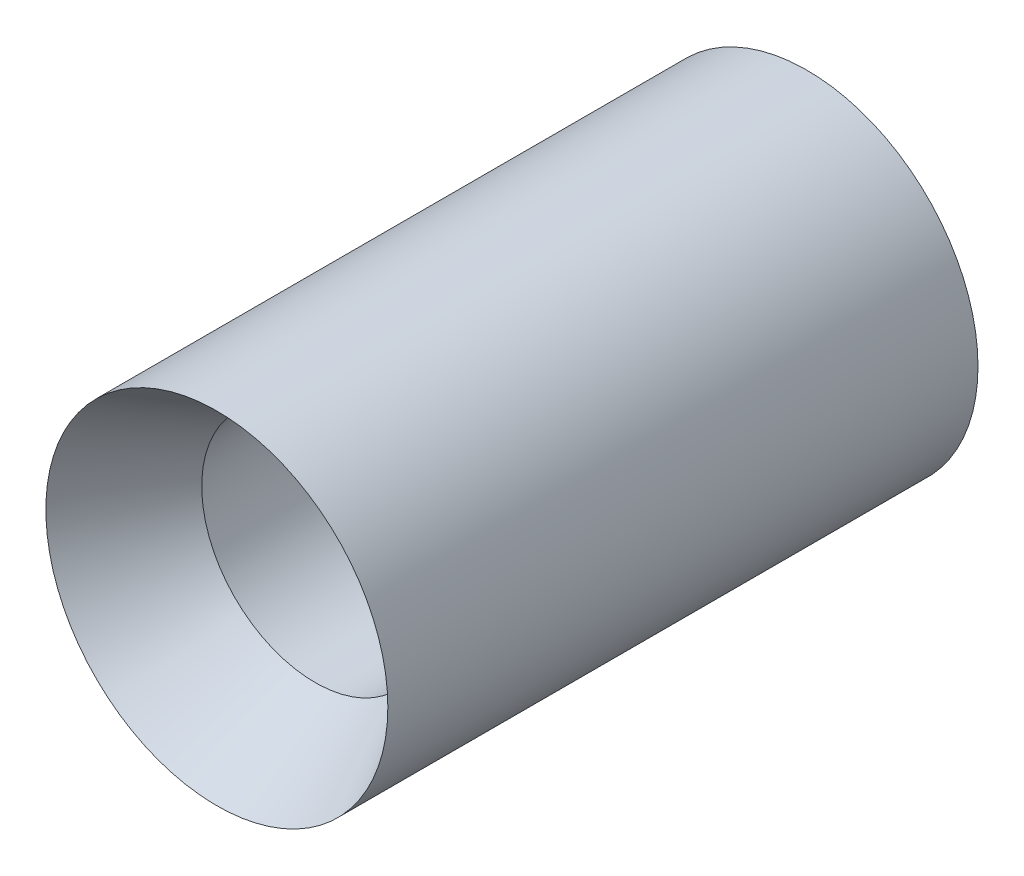
ISO-10303-21;
HEADER;
FILE_DESCRIPTION(('STEP AP214'),'2;1');
FILE_NAME('part.step','',(''),(''),'','','');
FILE_SCHEMA(('AUTOMOTIVE_DESIGN { 1 0 10303 214 1 1 1 1 }'));
ENDSEC;
DATA;
#1=APPLICATION_CONTEXT('core data for automotive mechanical design processes');
#2=APPLICATION_PROTOCOL_DEFINITION('international standard','automotive_design',2000,#1);
#3=PRODUCT_CONTEXT('',#1,'mechanical');
#4=PRODUCT('Part','Part','',(#3));
#5=PRODUCT_RELATED_PRODUCT_CATEGORY('part','',(#4));
#6=PRODUCT_DEFINITION_FORMATION('','',#4);
#7=PRODUCT_DEFINITION_CONTEXT('part definition',#1,'design');
#8=PRODUCT_DEFINITION('design','',#6,#7);
#9=PRODUCT_DEFINITION_SHAPE('','',#8);
#10=(LENGTH_UNIT() NAMED_UNIT(*) SI_UNIT(.MILLI.,.METRE.));
#11=(NAMED_UNIT(*) PLANE_ANGLE_UNIT() SI_UNIT($,.RADIAN.));
#12=(NAMED_UNIT(*) SI_UNIT($,.STERADIAN.) SOLID_ANGLE_UNIT());
#13=UNCERTAINTY_MEASURE_WITH_UNIT(LENGTH_MEASURE(1.E-05),#10,'distance_accuracy_value','');
#14=(GEOMETRIC_REPRESENTATION_CONTEXT(3) GLOBAL_UNCERTAINTY_ASSIGNED_CONTEXT((#13)) GLOBAL_UNIT_ASSIGNED_CONTEXT((#10,
#11,#12)) REPRESENTATION_CONTEXT('',''));
#15=CARTESIAN_POINT('',(0.,0.,0.));
#16=DIRECTION('',(0.,0.,1.));
#17=DIRECTION('',(1.,0.,0.));
#18=AXIS2_PLACEMENT_3D('',#15,#16,#17);
#19=CARTESIAN_POINT('',(0.,0.,0.));
#20=DIRECTION('',(0.,0.,1.));
#21=DIRECTION('',(1.,0.,0.));
#22=AXIS2_PLACEMENT_3D('',#19,#20,#21);
#23=CONICAL_SURFACE('',#22,14.351,0.529030471079648);
#24=CARTESIAN_POINT('',(0.,0.,-8.255));
#25=DIRECTION('',(0.,0.,1.));
#26=DIRECTION('',(1.,0.,0.));
#27=AXIS2_PLACEMENT_3D('',#24,#25,#26);
#28=CIRCLE('',#27,9.525);
#29=CARTESIAN_POINT('',(9.525,0.,-8.255));
#30=VERTEX_POINT('',#29);
#31=EDGE_CURVE('E54',#30,#30,#28,.T.);
#32=ORIENTED_EDGE('',*,*,#31,.F.);
#33=EDGE_LOOP('',(#32));
#34=FACE_BOUND('',#33,.T.);
#35=CARTESIAN_POINT('',(0.,0.,0.));
#36=DIRECTION('',(0.,0.,1.));
#37=DIRECTION('',(1.,0.,0.));
#38=AXIS2_PLACEMENT_3D('',#35,#36,#37);
#39=CIRCLE('',#38,14.351);
#40=CARTESIAN_POINT('',(14.351,0.,0.));
#41=VERTEX_POINT('',#40);
#42=EDGE_CURVE('E10',#41,#41,#39,.T.);
#43=ORIENTED_EDGE('',*,*,#42,.T.);
#44=EDGE_LOOP('',(#43));
#45=FACE_BOUND('',#44,.T.);
#46=ADVANCED_FACE('F35',(#34,#45),#23,.F.);
#47=CARTESIAN_POINT('',(0.,0.,0.));
#48=DIRECTION('',(0.,0.,1.));
#49=DIRECTION('',(1.,0.,0.));
#50=AXIS2_PLACEMENT_3D('',#47,#48,#49);
#51=CYLINDRICAL_SURFACE('',#50,14.351);
#52=ORIENTED_EDGE('',*,*,#42,.F.);
#53=EDGE_LOOP('',(#52));
#54=FACE_BOUND('',#53,.T.);
#55=CARTESIAN_POINT('',(0.,0.,-49.53));
#56=DIRECTION('',(0.,0.,1.));
#57=DIRECTION('',(1.,0.,0.));
#58=AXIS2_PLACEMENT_3D('',#55,#56,#57);
#59=CIRCLE('',#58,14.351);
#60=CARTESIAN_POINT('',(14.351,0.,-49.53));
#61=VERTEX_POINT('',#60);
#62=EDGE_CURVE('E41',#61,#61,#59,.T.);
#63=ORIENTED_EDGE('',*,*,#62,.T.);
#64=EDGE_LOOP('',(#63));
#65=FACE_BOUND('',#64,.T.);
#66=ADVANCED_FACE('F61',(#54,#65),#51,.T.);
#67=CARTESIAN_POINT('',(0.,12.720828,-49.53));
#68=DIRECTION('',(0.,0.,1.));
#69=DIRECTION('',(1.,0.,0.));
#70=AXIS2_PLACEMENT_3D('',#67,#68,#69);
#71=PLANE('',#70);
#72=ORIENTED_EDGE('',*,*,#62,.F.);
#73=EDGE_LOOP('',(#72));
#74=FACE_BOUND('',#73,.T.);
#75=CARTESIAN_POINT('',(0.,0.,-49.53));
#76=DIRECTION('',(0.,0.,1.));
#77=DIRECTION('',(1.,0.,0.));
#78=AXIS2_PLACEMENT_3D('',#75,#76,#77);
#79=CIRCLE('',#78,12.720828);
#80=CARTESIAN_POINT('',(12.720828,0.,-49.53));
#81=VERTEX_POINT('',#80);
#82=EDGE_CURVE('E45',#81,#81,#79,.T.);
#83=ORIENTED_EDGE('',*,*,#82,.T.);
#84=EDGE_LOOP('',(#83));
#85=FACE_BOUND('',#84,.T.);
#86=ADVANCED_FACE('F65',(#74,#85),#71,.F.);
#87=CARTESIAN_POINT('',(0.,0.,-24.13));
#88=DIRECTION('',(0.,0.,-1.));
#89=DIRECTION('',(-1.,0.,0.));
#90=AXIS2_PLACEMENT_3D('',#87,#88,#89);
#91=CONICAL_SURFACE('',#90,9.525,0.125162297511246);
#92=ORIENTED_EDGE('',*,*,#82,.F.);
#93=EDGE_LOOP('',(#92));
#94=FACE_BOUND('',#93,.T.);
#95=CARTESIAN_POINT('',(0.,0.,-24.13));
#96=DIRECTION('',(0.,0.,1.));
#97=DIRECTION('',(1.,0.,0.));
#98=AXIS2_PLACEMENT_3D('',#95,#96,#97);
#99=CIRCLE('',#98,9.525);
#100=CARTESIAN_POINT('',(9.525,0.,-24.13));
#101=VERTEX_POINT('',#100);
#102=EDGE_CURVE('E49',#101,#101,#99,.T.);
#103=ORIENTED_EDGE('',*,*,#102,.T.);
#104=EDGE_LOOP('',(#103));
#105=FACE_BOUND('',#104,.T.);
#106=ADVANCED_FACE('F70',(#94,#105),#91,.F.);
#107=CARTESIAN_POINT('',(0.,0.,0.));
#108=DIRECTION('',(0.,0.,1.));
#109=DIRECTION('',(1.,0.,0.));
#110=AXIS2_PLACEMENT_3D('',#107,#108,#109);
#111=CYLINDRICAL_SURFACE('',#110,9.525);
#112=ORIENTED_EDGE('',*,*,#102,.F.);
#113=EDGE_LOOP('',(#112));
#114=FACE_BOUND('',#113,.T.);
#115=ORIENTED_EDGE('',*,*,#31,.T.);
#116=EDGE_LOOP('',(#115));
#117=FACE_BOUND('',#116,.T.);
#118=ADVANCED_FACE('F58',(#114,#117),#111,.F.);
#119=CLOSED_SHELL('',(#46,#66,#86,#106,#118));
#120=MANIFOLD_SOLID_BREP('B2',#119);
#121=ADVANCED_BREP_SHAPE_REPRESENTATION('',(#18,#120),#14);
#122=SHAPE_DEFINITION_REPRESENTATION(#9,#121);
ENDSEC;
END-ISO-10303-21;
